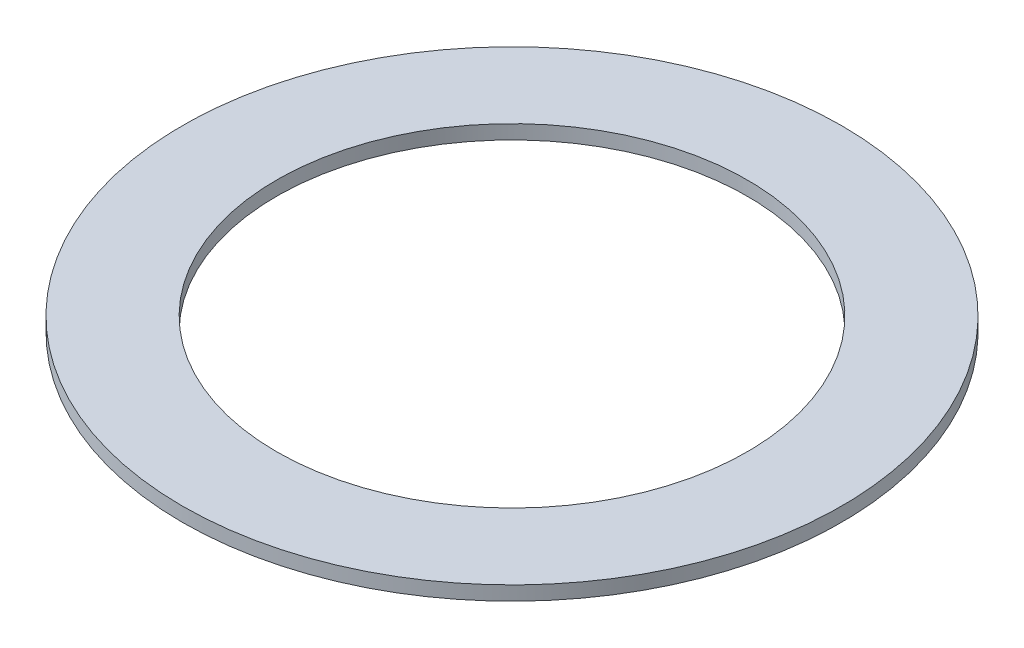
ISO-10303-21;
HEADER;
FILE_DESCRIPTION(('STEP AP214'),'2;1');
FILE_NAME('part.step','',(''),(''),'','','');
FILE_SCHEMA(('AUTOMOTIVE_DESIGN { 1 0 10303 214 1 1 1 1 }'));
ENDSEC;
DATA;
#1=APPLICATION_CONTEXT('core data for automotive mechanical design processes');
#2=APPLICATION_PROTOCOL_DEFINITION('international standard','automotive_design',2000,#1);
#3=PRODUCT_CONTEXT('',#1,'mechanical');
#4=PRODUCT('Part','Part','',(#3));
#5=PRODUCT_RELATED_PRODUCT_CATEGORY('part','',(#4));
#6=PRODUCT_DEFINITION_FORMATION('','',#4);
#7=PRODUCT_DEFINITION_CONTEXT('part definition',#1,'design');
#8=PRODUCT_DEFINITION('design','',#6,#7);
#9=PRODUCT_DEFINITION_SHAPE('','',#8);
#10=(LENGTH_UNIT() NAMED_UNIT(*) SI_UNIT(.MILLI.,.METRE.));
#11=(NAMED_UNIT(*) PLANE_ANGLE_UNIT() SI_UNIT($,.RADIAN.));
#12=(NAMED_UNIT(*) SI_UNIT($,.STERADIAN.) SOLID_ANGLE_UNIT());
#13=UNCERTAINTY_MEASURE_WITH_UNIT(LENGTH_MEASURE(1.E-05),#10,'distance_accuracy_value','');
#14=(GEOMETRIC_REPRESENTATION_CONTEXT(3) GLOBAL_UNCERTAINTY_ASSIGNED_CONTEXT((#13)) GLOBAL_UNIT_ASSIGNED_CONTEXT((#10,
#11,#12)) REPRESENTATION_CONTEXT('',''));
#15=CARTESIAN_POINT('',(0.,0.,0.));
#16=DIRECTION('',(0.,0.,1.));
#17=DIRECTION('',(1.,0.,0.));
#18=AXIS2_PLACEMENT_3D('',#15,#16,#17);
#19=CARTESIAN_POINT('',(0.,-1.905,0.));
#20=DIRECTION('',(0.,1.,0.));
#21=DIRECTION('',(0.,0.,1.));
#22=AXIS2_PLACEMENT_3D('',#19,#20,#21);
#23=CYLINDRICAL_SURFACE('',#22,88.9);
#24=CARTESIAN_POINT('',(0.,-1.905,0.));
#25=DIRECTION('',(0.,1.,0.));
#26=DIRECTION('',(0.,0.,1.));
#27=AXIS2_PLACEMENT_3D('',#24,#25,#26);
#28=CIRCLE('',#27,88.9);
#29=CARTESIAN_POINT('',(0.,-1.905,88.9));
#30=VERTEX_POINT('',#29);
#31=EDGE_CURVE('E46',#30,#30,#28,.T.);
#32=ORIENTED_EDGE('',*,*,#31,.T.);
#33=EDGE_LOOP('',(#32));
#34=FACE_BOUND('',#33,.T.);
#35=CARTESIAN_POINT('',(0.,1.905,0.));
#36=DIRECTION('',(0.,1.,0.));
#37=DIRECTION('',(0.,0.,1.));
#38=AXIS2_PLACEMENT_3D('',#35,#36,#37);
#39=CIRCLE('',#38,88.9);
#40=CARTESIAN_POINT('',(0.,1.905,88.9));
#41=VERTEX_POINT('',#40);
#42=EDGE_CURVE('E56',#41,#41,#39,.T.);
#43=ORIENTED_EDGE('',*,*,#42,.F.);
#44=EDGE_LOOP('',(#43));
#45=FACE_BOUND('',#44,.T.);
#46=ADVANCED_FACE('F39',(#34,#45),#23,.T.);
#47=CARTESIAN_POINT('',(0.,-1.905,0.));
#48=DIRECTION('',(0.,1.,0.));
#49=DIRECTION('',(0.,0.,1.));
#50=AXIS2_PLACEMENT_3D('',#47,#48,#49);
#51=CYLINDRICAL_SURFACE('',#50,63.5);
#52=CARTESIAN_POINT('',(0.,-1.905,0.));
#53=DIRECTION('',(0.,1.,0.));
#54=DIRECTION('',(0.,0.,1.));
#55=AXIS2_PLACEMENT_3D('',#52,#53,#54);
#56=CIRCLE('',#55,63.5);
#57=CARTESIAN_POINT('',(0.,-1.905,63.5));
#58=VERTEX_POINT('',#57);
#59=EDGE_CURVE('E10',#58,#58,#56,.T.);
#60=ORIENTED_EDGE('',*,*,#59,.F.);
#61=EDGE_LOOP('',(#60));
#62=FACE_BOUND('',#61,.T.);
#63=CARTESIAN_POINT('',(0.,1.905,0.));
#64=DIRECTION('',(0.,1.,0.));
#65=DIRECTION('',(0.,0.,1.));
#66=AXIS2_PLACEMENT_3D('',#63,#64,#65);
#67=CIRCLE('',#66,63.5);
#68=CARTESIAN_POINT('',(0.,1.905,63.5));
#69=VERTEX_POINT('',#68);
#70=EDGE_CURVE('E51',#69,#69,#67,.T.);
#71=ORIENTED_EDGE('',*,*,#70,.T.);
#72=EDGE_LOOP('',(#71));
#73=FACE_BOUND('',#72,.T.);
#74=ADVANCED_FACE('F67',(#62,#73),#51,.F.);
#75=CARTESIAN_POINT('',(0.,-1.905,0.));
#76=DIRECTION('',(0.,1.,0.));
#77=DIRECTION('',(0.,0.,1.));
#78=AXIS2_PLACEMENT_3D('',#75,#76,#77);
#79=PLANE('',#78);
#80=ORIENTED_EDGE('',*,*,#31,.F.);
#81=EDGE_LOOP('',(#80));
#82=FACE_BOUND('',#81,.T.);
#83=ORIENTED_EDGE('',*,*,#59,.T.);
#84=EDGE_LOOP('',(#83));
#85=FACE_BOUND('',#84,.T.);
#86=ADVANCED_FACE('F71',(#82,#85),#79,.F.);
#87=CARTESIAN_POINT('',(0.,1.905,0.));
#88=DIRECTION('',(0.,1.,0.));
#89=DIRECTION('',(0.,0.,1.));
#90=AXIS2_PLACEMENT_3D('',#87,#88,#89);
#91=PLANE('',#90);
#92=ORIENTED_EDGE('',*,*,#42,.T.);
#93=EDGE_LOOP('',(#92));
#94=FACE_BOUND('',#93,.T.);
#95=ORIENTED_EDGE('',*,*,#70,.F.);
#96=EDGE_LOOP('',(#95));
#97=FACE_BOUND('',#96,.T.);
#98=ADVANCED_FACE('F63',(#94,#97),#91,.T.);
#99=CLOSED_SHELL('',(#46,#74,#86,#98));
#100=MANIFOLD_SOLID_BREP('B2',#99);
#101=ADVANCED_BREP_SHAPE_REPRESENTATION('',(#18,#100),#14);
#102=SHAPE_DEFINITION_REPRESENTATION(#9,#101);
ENDSEC;
END-ISO-10303-21;
